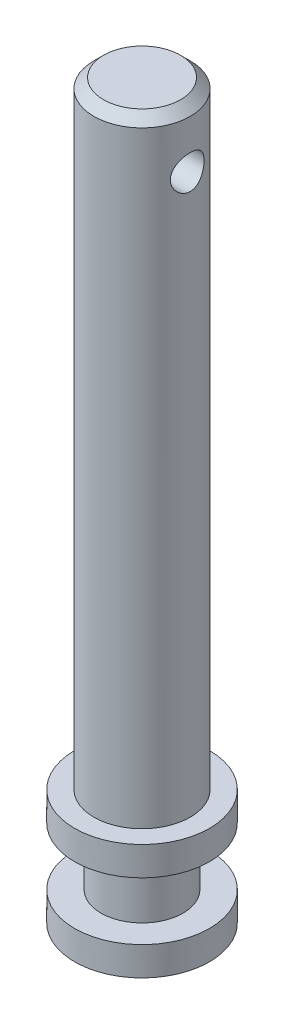
ISO-10303-21;
HEADER;
FILE_DESCRIPTION(('STEP AP214'),'2;1');
FILE_NAME('part.step','',(''),(''),'','','');
FILE_SCHEMA(('AUTOMOTIVE_DESIGN { 1 0 10303 214 1 1 1 1 }'));
ENDSEC;
DATA;
#1=APPLICATION_CONTEXT('core data for automotive mechanical design processes');
#2=APPLICATION_PROTOCOL_DEFINITION('international standard','automotive_design',2000,#1);
#3=PRODUCT_CONTEXT('',#1,'mechanical');
#4=PRODUCT('Part','Part','',(#3));
#5=PRODUCT_RELATED_PRODUCT_CATEGORY('part','',(#4));
#6=PRODUCT_DEFINITION_FORMATION('','',#4);
#7=PRODUCT_DEFINITION_CONTEXT('part definition',#1,'design');
#8=PRODUCT_DEFINITION('design','',#6,#7);
#9=PRODUCT_DEFINITION_SHAPE('','',#8);
#10=(LENGTH_UNIT() NAMED_UNIT(*) SI_UNIT(.MILLI.,.METRE.));
#11=(NAMED_UNIT(*) PLANE_ANGLE_UNIT() SI_UNIT($,.RADIAN.));
#12=(NAMED_UNIT(*) SI_UNIT($,.STERADIAN.) SOLID_ANGLE_UNIT());
#13=UNCERTAINTY_MEASURE_WITH_UNIT(LENGTH_MEASURE(1.E-05),#10,'distance_accuracy_value','');
#14=(GEOMETRIC_REPRESENTATION_CONTEXT(3) GLOBAL_UNCERTAINTY_ASSIGNED_CONTEXT((#13)) GLOBAL_UNIT_ASSIGNED_CONTEXT((#10,
#11,#12)) REPRESENTATION_CONTEXT('',''));
#15=CARTESIAN_POINT('',(0.,0.,0.));
#16=DIRECTION('',(0.,0.,1.));
#17=DIRECTION('',(1.,0.,0.));
#18=AXIS2_PLACEMENT_3D('',#15,#16,#17);
#19=CARTESIAN_POINT('',(-39.058136074314,-26.2499999999966,157.22281178723));
#20=DIRECTION('',(0.,1.,0.));
#21=DIRECTION('',(1.,0.,0.));
#22=AXIS2_PLACEMENT_3D('',#19,#20,#21);
#23=CYLINDRICAL_SURFACE('',#22,2.5);
#24=CARTESIAN_POINT('',(-39.058136074314,-41.4999999999966,157.22281178723));
#25=DIRECTION('',(0.,1.,0.));
#26=DIRECTION('',(0.,0.,1.));
#27=AXIS2_PLACEMENT_3D('',#24,#25,#26);
#28=CIRCLE('',#27,2.5);
#29=CARTESIAN_POINT('',(-39.058136074314,-41.4999999999966,159.72281178723));
#30=VERTEX_POINT('',#29);
#31=EDGE_CURVE('E11',#30,#30,#28,.T.);
#32=ORIENTED_EDGE('',*,*,#31,.T.);
#33=EDGE_LOOP('',(#32));
#34=FACE_BOUND('',#33,.T.);
#35=CARTESIAN_POINT('',(-41.4000103237135,-12.4999999999966,156.34781178723));
#36=CARTESIAN_POINT('',(-41.4000128155673,-12.4525643744031,156.347814581099));
#37=CARTESIAN_POINT('',(-41.4014699688432,-12.405080982804,156.351688048593));
#38=CARTESIAN_POINT('',(-41.4071189158149,-12.3114822821099,156.367041308693));
#39=CARTESIAN_POINT('',(-41.4113152416717,-12.2653693730179,156.378533707872));
#40=CARTESIAN_POINT('',(-41.4219066149587,-12.1759584925006,156.408661253374));
#41=CARTESIAN_POINT('',(-41.428295590332,-12.1326531358301,156.427276690216));
#42=CARTESIAN_POINT('',(-41.4425443595289,-12.049780368141,156.471063773624));
#43=CARTESIAN_POINT('',(-41.4504040694668,-12.0102127441288,156.496235046299));
#44=CARTESIAN_POINT('',(-41.4670917410137,-11.934206453069,156.553590361887));
#45=CARTESIAN_POINT('',(-41.4759456419171,-11.8979523340745,156.586011507403));
#46=CARTESIAN_POINT('',(-41.4934062894891,-11.8312670480141,156.656442660265));
#47=CARTESIAN_POINT('',(-41.502012979422,-11.8008372087035,156.694453938504));
#48=CARTESIAN_POINT('',(-41.5183112278842,-11.7458124363955,156.776349307166));
#49=CARTESIAN_POINT('',(-41.52596889802,-11.721412905451,156.820372030095));
#50=CARTESIAN_POINT('',(-41.5391994917302,-11.6804400413319,156.912211575258));
#51=CARTESIAN_POINT('',(-41.5447730450645,-11.6638643436229,156.960027246069));
#52=CARTESIAN_POINT('',(-41.5530241605874,-11.6396416058075,157.056164569138));
#53=CARTESIAN_POINT('',(-41.5558038508943,-11.6316788129222,157.10439773267));
#54=CARTESIAN_POINT('',(-41.5585181116683,-11.6239009561735,157.201590391781));
#55=CARTESIAN_POINT('',(-41.5584534893711,-11.6240835805844,157.250549677337));
#56=CARTESIAN_POINT('',(-41.5555539886184,-11.632397395959,157.345558837886));
#57=CARTESIAN_POINT('',(-41.5528388680633,-11.6401849763844,157.391643047599));
#58=CARTESIAN_POINT('',(-41.5450963861253,-11.6629157051348,157.481803741582));
#59=CARTESIAN_POINT('',(-41.5400688560821,-11.6778593754067,157.525880079146));
#60=CARTESIAN_POINT('',(-41.5281206014158,-11.7146627675042,157.611491546445));
#61=CARTESIAN_POINT('',(-41.5211747052606,-11.7366150956804,157.652983207425));
#62=CARTESIAN_POINT('',(-41.5061054879057,-11.7867332823933,157.731788911272));
#63=CARTESIAN_POINT('',(-41.4979818744656,-11.8149006840557,157.769101913155));
#64=CARTESIAN_POINT('',(-41.4809127973856,-11.8783476087382,157.840525823231));
#65=CARTESIAN_POINT('',(-41.4719465531903,-11.9139183665437,157.874373415935));
#66=CARTESIAN_POINT('',(-41.454544734501,-11.990313336596,157.935725090454));
#67=CARTESIAN_POINT('',(-41.4461094341923,-12.0311402305631,157.96322591396));
#68=CARTESIAN_POINT('',(-41.4306015494636,-12.1178142898754,158.011522368804));
#69=CARTESIAN_POINT('',(-41.4235559191753,-12.1637379343829,158.03218981816));
#70=CARTESIAN_POINT('',(-41.4119434232296,-12.2586762563588,158.065370398614));
#71=CARTESIAN_POINT('',(-41.4073712840484,-12.3076841070483,158.077900889367));
#72=CARTESIAN_POINT('',(-41.4029145791526,-12.3809683878494,158.090007114875));
#73=CARTESIAN_POINT('',(-41.4018294990079,-12.4046630677047,158.092929884686));
#74=CARTESIAN_POINT('',(-41.4003767424862,-12.4522344598068,158.096832928014));
#75=CARTESIAN_POINT('',(-41.400009068803,-12.4761111727367,158.097813194237));
#76=CARTESIAN_POINT('',(-41.4000128155672,-12.5474356255879,158.09780899336));
#77=CARTESIAN_POINT('',(-41.4014699688431,-12.594919017187,158.093935525867));
#78=CARTESIAN_POINT('',(-41.4071189158147,-12.6885177178811,158.078582265767));
#79=CARTESIAN_POINT('',(-41.4113152416715,-12.7346306269732,158.067089866588));
#80=CARTESIAN_POINT('',(-41.4219066149584,-12.8240415074904,158.036962321087));
#81=CARTESIAN_POINT('',(-41.4282955903317,-12.867346864161,158.018346884244));
#82=CARTESIAN_POINT('',(-41.4425443595285,-12.9502196318501,157.974559800836));
#83=CARTESIAN_POINT('',(-41.4504040694665,-12.9897872558624,157.949388528161));
#84=CARTESIAN_POINT('',(-41.4670917410133,-13.0657935469224,157.892033212574));
#85=CARTESIAN_POINT('',(-41.4759456419167,-13.102047665917,157.859612067058));
#86=CARTESIAN_POINT('',(-41.4934062894886,-13.1687329519775,157.789180914196));
#87=CARTESIAN_POINT('',(-41.5020129794216,-13.1991627912882,157.751169635957));
#88=CARTESIAN_POINT('',(-41.5183112278838,-13.2541875635965,157.669274267296));
#89=CARTESIAN_POINT('',(-41.5259688980197,-13.278587094541,157.625251544366));
#90=CARTESIAN_POINT('',(-41.5391994917299,-13.3195599586604,157.533411999204));
#91=CARTESIAN_POINT('',(-41.5447730450642,-13.3361356563696,157.485596328393));
#92=CARTESIAN_POINT('',(-41.5530241605873,-13.3603583941853,157.389459005324));
#93=CARTESIAN_POINT('',(-41.5558038508942,-13.3683211870707,157.341225841791));
#94=CARTESIAN_POINT('',(-41.5585181116683,-13.3760990438197,157.244033182681));
#95=CARTESIAN_POINT('',(-41.5584534893711,-13.3759164194089,157.195073897125));
#96=CARTESIAN_POINT('',(-41.5555539886185,-13.3676026040345,157.100064736575));
#97=CARTESIAN_POINT('',(-41.5528388680635,-13.3598150236093,157.053980526863));
#98=CARTESIAN_POINT('',(-41.5450963861255,-13.3370842948591,156.96381983288));
#99=CARTESIAN_POINT('',(-41.5400688560824,-13.3221406245873,156.919743495316));
#100=CARTESIAN_POINT('',(-41.5281206014161,-13.28533723249,156.834132028016));
#101=CARTESIAN_POINT('',(-41.521174705261,-13.2633849043139,156.792640367037));
#102=CARTESIAN_POINT('',(-41.5061054879062,-13.2132667176013,156.71383466319));
#103=CARTESIAN_POINT('',(-41.497981874466,-13.185099315939,156.676521661306));
#104=CARTESIAN_POINT('',(-41.480912797386,-13.1216523912567,156.60509775123));
#105=CARTESIAN_POINT('',(-41.4719465531908,-13.0860816334513,156.571250158527));
#106=CARTESIAN_POINT('',(-41.4545447345014,-13.0096866633992,156.509898484006));
#107=CARTESIAN_POINT('',(-41.4461094341927,-12.9688597694322,156.4823976605));
#108=CARTESIAN_POINT('',(-41.430601549464,-12.88218571012,156.434101205657));
#109=CARTESIAN_POINT('',(-41.4235559191757,-12.8362620656126,156.4134337563));
#110=CARTESIAN_POINT('',(-41.4119434232299,-12.7413237436368,156.380253175847));
#111=CARTESIAN_POINT('',(-41.4073712840486,-12.6923158929474,156.367722685093));
#112=CARTESIAN_POINT('',(-41.4029145791527,-12.6190316121455,156.355616459584));
#113=CARTESIAN_POINT('',(-41.4018294990079,-12.5953369322894,156.352693689773));
#114=CARTESIAN_POINT('',(-41.4003767424861,-12.5477655401858,156.348790646446));
#115=CARTESIAN_POINT('',(-41.4000090688029,-12.5238888272551,156.347810380223));
#116=CARTESIAN_POINT('',(-41.4000103237135,-12.4999999999966,156.34781178723));
#117=B_SPLINE_CURVE_WITH_KNOTS('',3,(#35,#36,#37,#38,#39,#40,#41,#42,#43,#44,#45,#46,#47,#48,
#49,#50,#51,#52,#53,#54,#55,#56,#57,#58,#59,#60,#61,#62,#63,#64,#65,#66,#67,#68,#69,#70,#71,#72,
#73,#74,#75,#76,#77,#78,#79,#80,#81,#82,#83,#84,#85,#86,#87,#88,#89,#90,#91,#92,#93,#94,#95,#96,
#97,#98,#99,#100,#101,#102,#103,#104,#105,#106,#107,#108,#109,#110,#111,#112,#113,#114,#115,
#116),.UNSPECIFIED.,.T.,.F.,(4,2,2,2,2,2,2,2,2,2,2,2,2,2,2,2,2,2,2,2,2,2,2,2,2,2,2,2,2,2,2,2,2,
2,2,2,2,2,2,2,4),(0.,0.142213785233003,0.284663472038125,0.426721817299711,0.568772062516017,
0.716415538396299,0.864092632428542,1.01606398397431,1.16798937698312,1.31413369781763,
1.46023654214992,1.60002973138888,1.73983311833968,1.88156602229608,2.02333415645526,
2.17239216200834,2.32152652172129,2.47331772809518,2.6247840248101,2.6964033562776,
2.7680229566641,2.91023674189706,3.05268642870212,3.19474477396364,3.33679501917988,
3.4844384950601,3.63211558909229,3.78408694063808,3.93601233364691,4.08215665448146,
4.22825949881383,4.36805268805281,4.50785607500365,4.64958897896,4.79135711311912,
4.94041511867215,5.08954947838504,5.24134068475893,5.3928069814739,5.46442631294372,
5.53604591333256),.UNSPECIFIED.);
#118=CARTESIAN_POINT('',(-41.4000103237135,-12.4999999999966,156.34781178723));
#119=VERTEX_POINT('',#118);
#120=EDGE_CURVE('E25',#119,#119,#117,.T.);
#121=ORIENTED_EDGE('',*,*,#120,.T.);
#122=EDGE_LOOP('',(#121));
#123=FACE_BOUND('',#122,.T.);
#124=CARTESIAN_POINT('',(-39.058136074314,-10.0000000000755,157.22281178723));
#125=DIRECTION('',(0.,-1.,0.));
#126=DIRECTION('',(0.,0.,-1.));
#127=AXIS2_PLACEMENT_3D('',#124,#125,#126);
#128=CIRCLE('',#127,2.5);
#129=CARTESIAN_POINT('',(-39.058136074314,-10.0000000000755,154.72281178723));
#130=VERTEX_POINT('',#129);
#131=EDGE_CURVE('E100',#130,#130,#128,.T.);
#132=ORIENTED_EDGE('',*,*,#131,.T.);
#133=EDGE_LOOP('',(#132));
#134=FACE_BOUND('',#133,.T.);
#135=CARTESIAN_POINT('',(-36.7162618249146,-12.4999999999966,156.34781178723));
#136=CARTESIAN_POINT('',(-36.7162593330608,-12.5474356255901,156.347814581099));
#137=CARTESIAN_POINT('',(-36.7148021797849,-12.5949190171892,156.351688048593));
#138=CARTESIAN_POINT('',(-36.7091532328132,-12.6885177178833,156.367041308693));
#139=CARTESIAN_POINT('',(-36.7049569069564,-12.7346306269753,156.378533707872));
#140=CARTESIAN_POINT('',(-36.6943655336694,-12.8240415074926,156.408661253374));
#141=CARTESIAN_POINT('',(-36.6879765582961,-12.8673468641631,156.427276690216));
#142=CARTESIAN_POINT('',(-36.6737277890992,-12.9502196318522,156.471063773624));
#143=CARTESIAN_POINT('',(-36.6658680791612,-12.9897872558644,156.496235046299));
#144=CARTESIAN_POINT('',(-36.6491804076144,-13.0657935469242,156.553590361887));
#145=CARTESIAN_POINT('',(-36.640326506711,-13.1020476659187,156.586011507403));
#146=CARTESIAN_POINT('',(-36.622865859139,-13.1687329519791,156.656442660265));
#147=CARTESIAN_POINT('',(-36.6142591692061,-13.1991627912897,156.694453938504));
#148=CARTESIAN_POINT('',(-36.5979609207439,-13.2541875635977,156.776349307166));
#149=CARTESIAN_POINT('',(-36.5903032506081,-13.2785870945422,156.820372030095));
#150=CARTESIAN_POINT('',(-36.5770726568979,-13.3195599586613,156.912211575258));
#151=CARTESIAN_POINT('',(-36.5714991035636,-13.3361356563703,156.960027246069));
#152=CARTESIAN_POINT('',(-36.5632479880407,-13.3603583941857,157.056164569138));
#153=CARTESIAN_POINT('',(-36.5604682977338,-13.368321187071,157.10439773267));
#154=CARTESIAN_POINT('',(-36.5577540369598,-13.3760990438198,157.201590391781));
#155=CARTESIAN_POINT('',(-36.557818659257,-13.3759164194088,157.250549677337));
#156=CARTESIAN_POINT('',(-36.5607181600097,-13.3676026040342,157.345558837886));
#157=CARTESIAN_POINT('',(-36.5634332805648,-13.3598150236088,157.391643047599));
#158=CARTESIAN_POINT('',(-36.5711757625028,-13.3370842948584,157.481803741582));
#159=CARTESIAN_POINT('',(-36.576203292546,-13.3221406245865,157.525880079146));
#160=CARTESIAN_POINT('',(-36.5881515472123,-13.285337232489,157.611491546445));
#161=CARTESIAN_POINT('',(-36.5950974433675,-13.2633849043128,157.652983207425));
#162=CARTESIAN_POINT('',(-36.6101666607223,-13.2132667175999,157.731788911272));
#163=CARTESIAN_POINT('',(-36.6182902741625,-13.1850993159375,157.769101913155));
#164=CARTESIAN_POINT('',(-36.6353593512425,-13.121652391255,157.840525823231));
#165=CARTESIAN_POINT('',(-36.6443255954378,-13.0860816334495,157.874373415935));
#166=CARTESIAN_POINT('',(-36.6617274141271,-13.0096866633972,157.935725090454));
#167=CARTESIAN_POINT('',(-36.6701627144358,-12.9688597694301,157.96322591396));
#168=CARTESIAN_POINT('',(-36.6856705991645,-12.8821857101178,158.011522368804));
#169=CARTESIAN_POINT('',(-36.6927162294528,-12.8362620656103,158.03218981816));
#170=CARTESIAN_POINT('',(-36.7043287253985,-12.7413237436344,158.065370398614));
#171=CARTESIAN_POINT('',(-36.7089008645797,-12.6923158929449,158.077900889367));
#172=CARTESIAN_POINT('',(-36.7133575694755,-12.6190316121438,158.090007114875));
#173=CARTESIAN_POINT('',(-36.7144426496202,-12.5953369322885,158.092929884686));
#174=CARTESIAN_POINT('',(-36.7158954061419,-12.5477655401864,158.096832928014));
#175=CARTESIAN_POINT('',(-36.7162630798251,-12.5238888272565,158.097813194237));
#176=CARTESIAN_POINT('',(-36.7162593330609,-12.4525643744053,158.09780899336));
#177=CARTESIAN_POINT('',(-36.714802179785,-12.4050809828062,158.093935525867));
#178=CARTESIAN_POINT('',(-36.7091532328134,-12.3114822821121,158.078582265767));
#179=CARTESIAN_POINT('',(-36.7049569069566,-12.26536937302,158.067089866588));
#180=CARTESIAN_POINT('',(-36.6943655336697,-12.1759584925028,158.036962321087));
#181=CARTESIAN_POINT('',(-36.6879765582964,-12.1326531358322,158.018346884244));
#182=CARTESIAN_POINT('',(-36.6737277890996,-12.049780368143,157.974559800836));
#183=CARTESIAN_POINT('',(-36.6658680791616,-12.0102127441307,157.949388528161));
#184=CARTESIAN_POINT('',(-36.6491804076148,-11.9342064530708,157.892033212574));
#185=CARTESIAN_POINT('',(-36.6403265067114,-11.8979523340762,157.859612067058));
#186=CARTESIAN_POINT('',(-36.6228658591395,-11.8312670480157,157.789180914196));
#187=CARTESIAN_POINT('',(-36.6142591692065,-11.800837208705,157.751169635957));
#188=CARTESIAN_POINT('',(-36.5979609207443,-11.7458124363967,157.669274267296));
#189=CARTESIAN_POINT('',(-36.5903032506084,-11.7214129054522,157.625251544366));
#190=CARTESIAN_POINT('',(-36.5770726568982,-11.6804400413328,157.533411999204));
#191=CARTESIAN_POINT('',(-36.5714991035639,-11.6638643436236,157.485596328393));
#192=CARTESIAN_POINT('',(-36.5632479880408,-11.6396416058079,157.389459005324));
#193=CARTESIAN_POINT('',(-36.5604682977339,-11.6316788129225,157.341225841791));
#194=CARTESIAN_POINT('',(-36.5577540369598,-11.6239009561735,157.244033182681));
#195=CARTESIAN_POINT('',(-36.557818659257,-11.6240835805843,157.195073897125));
#196=CARTESIAN_POINT('',(-36.5607181600096,-11.6323973959587,157.100064736575));
#197=CARTESIAN_POINT('',(-36.5634332805646,-11.6401849763839,157.053980526863));
#198=CARTESIAN_POINT('',(-36.5711757625026,-11.6629157051341,156.96381983288));
#199=CARTESIAN_POINT('',(-36.5762032925457,-11.6778593754059,156.919743495316));
#200=CARTESIAN_POINT('',(-36.588151547212,-11.7146627675032,156.834132028016));
#201=CARTESIAN_POINT('',(-36.5950974433671,-11.7366150956793,156.792640367037));
#202=CARTESIAN_POINT('',(-36.610166660722,-11.7867332823919,156.71383466319));
#203=CARTESIAN_POINT('',(-36.6182902741621,-11.8149006840542,156.676521661306));
#204=CARTESIAN_POINT('',(-36.6353593512421,-11.8783476087365,156.60509775123));
#205=CARTESIAN_POINT('',(-36.6443255954373,-11.9139183665419,156.571250158527));
#206=CARTESIAN_POINT('',(-36.6617274141267,-11.9903133365941,156.509898484006));
#207=CARTESIAN_POINT('',(-36.6701627144354,-12.031140230561,156.4823976605));
#208=CARTESIAN_POINT('',(-36.6856705991641,-12.1178142898732,156.434101205657));
#209=CARTESIAN_POINT('',(-36.6927162294524,-12.1637379343806,156.4134337563));
#210=CARTESIAN_POINT('',(-36.7043287253982,-12.2586762563564,156.380253175847));
#211=CARTESIAN_POINT('',(-36.7089008645795,-12.3076841070458,156.367722685093));
#212=CARTESIAN_POINT('',(-36.7133575694754,-12.3809683878477,156.355616459584));
#213=CARTESIAN_POINT('',(-36.7144426496202,-12.4046630677038,156.352693689773));
#214=CARTESIAN_POINT('',(-36.715895406142,-12.4522344598074,156.348790646446));
#215=CARTESIAN_POINT('',(-36.7162630798252,-12.4761111727381,156.347810380223));
#216=CARTESIAN_POINT('',(-36.7162618249146,-12.4999999999966,156.34781178723));
#217=B_SPLINE_CURVE_WITH_KNOTS('',3,(#135,#136,#137,#138,#139,#140,#141,#142,#143,#144,#145,
#146,#147,#148,#149,#150,#151,#152,#153,#154,#155,#156,#157,#158,#159,#160,#161,#162,#163,#164,
#165,#166,#167,#168,#169,#170,#171,#172,#173,#174,#175,#176,#177,#178,#179,#180,#181,#182,#183,
#184,#185,#186,#187,#188,#189,#190,#191,#192,#193,#194,#195,#196,#197,#198,#199,#200,#201,#202,
#203,#204,#205,#206,#207,#208,#209,#210,#211,#212,#213,#214,#215,#216),.UNSPECIFIED.,.T.,.F.,(4,
2,2,2,2,2,2,2,2,2,2,2,2,2,2,2,2,2,2,2,2,2,2,2,2,2,2,2,2,2,2,2,2,2,2,2,2,2,2,2,4),(0.,
0.142213785233007,0.284663472038125,0.426721817299711,0.568772062516018,0.716415538396299,
0.864092632428543,1.01606398397431,1.16798937698312,1.31413369781763,1.46023654214992,
1.60002973138888,1.73983311833968,1.88156602229611,2.02333415645529,2.17239216200834,
2.3215265217213,2.47331772809518,2.62478402481011,2.6964033562776,2.7680229566641,
2.91023674189706,3.05268642870213,3.19474477396368,3.33679501917991,3.48443849506013,
3.63211558909229,3.78408694063808,3.93601233364691,4.08215665448146,4.22825949881383,
4.36805268805281,4.50785607500368,4.64958897896003,4.79135711311916,4.94041511867216,
5.08954947838504,5.24134068475894,5.39280698147391,5.46442631294372,5.53604591333256),.UNSPECIFIED.);
#218=CARTESIAN_POINT('',(-36.7162618249146,-12.4999999999966,156.34781178723));
#219=VERTEX_POINT('',#218);
#220=EDGE_CURVE('E94',#219,#219,#217,.T.);
#221=ORIENTED_EDGE('',*,*,#220,.T.);
#222=EDGE_LOOP('',(#221));
#223=FACE_BOUND('',#222,.T.);
#224=ADVANCED_FACE('F16',(#34,#123,#134,#223),#23,.T.);
#225=CARTESIAN_POINT('',(-34.058136074314,-12.4999999999966,157.22281178723));
#226=DIRECTION('',(1.,0.,0.));
#227=DIRECTION('',(0.,1.,0.));
#228=AXIS2_PLACEMENT_3D('',#225,#226,#227);
#229=CYLINDRICAL_SURFACE('',#228,0.874999999999987);
#230=ORIENTED_EDGE('',*,*,#120,.F.);
#231=EDGE_LOOP('',(#230));
#232=FACE_BOUND('',#231,.T.);
#233=ORIENTED_EDGE('',*,*,#220,.F.);
#234=EDGE_LOOP('',(#233));
#235=FACE_BOUND('',#234,.T.);
#236=ADVANCED_FACE('F18',(#232,#235),#229,.F.);
#237=CARTESIAN_POINT('',(-39.058136074314,-9.99999999999091,157.22281178723));
#238=DIRECTION('',(0.,-1.,0.));
#239=DIRECTION('',(0.,0.,-1.));
#240=AXIS2_PLACEMENT_3D('',#237,#238,#239);
#241=CONICAL_SURFACE('',#240,2.49999999991538,0.785398163397448);
#242=CARTESIAN_POINT('',(-39.058136074314,-9.4999999999966,157.22281178723));
#243=DIRECTION('',(0.,1.,0.));
#244=DIRECTION('',(0.,0.,1.));
#245=AXIS2_PLACEMENT_3D('',#242,#243,#244);
#246=CIRCLE('',#245,1.99999999992107);
#247=CARTESIAN_POINT('',(-39.058136074314,-9.4999999999966,159.222811787151));
#248=VERTEX_POINT('',#247);
#249=EDGE_CURVE('E101',#248,#248,#246,.F.);
#250=ORIENTED_EDGE('',*,*,#249,.T.);
#251=EDGE_LOOP('',(#250));
#252=FACE_BOUND('',#251,.T.);
#253=ORIENTED_EDGE('',*,*,#131,.F.);
#254=EDGE_LOOP('',(#253));
#255=FACE_BOUND('',#254,.T.);
#256=ADVANCED_FACE('F64',(#252,#255),#241,.T.);
#257=CARTESIAN_POINT('',(-39.058136074314,-42.2499999999966,157.22281178723));
#258=DIRECTION('',(0.,1.,0.));
#259=DIRECTION('',(1.,0.,0.));
#260=AXIS2_PLACEMENT_3D('',#257,#258,#259);
#261=CYLINDRICAL_SURFACE('',#260,3.5);
#262=CARTESIAN_POINT('',(-39.058136074314,-42.9999999999966,157.22281178723));
#263=DIRECTION('',(0.,-1.,0.));
#264=DIRECTION('',(0.,0.,-1.));
#265=AXIS2_PLACEMENT_3D('',#262,#263,#264);
#266=CIRCLE('',#265,3.5);
#267=CARTESIAN_POINT('',(-39.058136074314,-42.9999999999966,153.72281178723));
#268=VERTEX_POINT('',#267);
#269=EDGE_CURVE('E104',#268,#268,#266,.F.);
#270=ORIENTED_EDGE('',*,*,#269,.T.);
#271=EDGE_LOOP('',(#270));
#272=FACE_BOUND('',#271,.T.);
#273=CARTESIAN_POINT('',(-39.058136074314,-41.4999999999966,157.22281178723));
#274=DIRECTION('',(0.,1.,0.));
#275=DIRECTION('',(0.,0.,1.));
#276=AXIS2_PLACEMENT_3D('',#273,#274,#275);
#277=CIRCLE('',#276,3.5);
#278=CARTESIAN_POINT('',(-39.058136074314,-41.4999999999966,160.72281178723));
#279=VERTEX_POINT('',#278);
#280=EDGE_CURVE('E21',#279,#279,#277,.T.);
#281=ORIENTED_EDGE('',*,*,#280,.F.);
#282=EDGE_LOOP('',(#281));
#283=FACE_BOUND('',#282,.T.);
#284=ADVANCED_FACE('F61',(#272,#283),#261,.T.);
#285=CARTESIAN_POINT('',(-39.058136074314,-44.4999999999966,157.22281178723));
#286=DIRECTION('',(0.,1.,0.));
#287=DIRECTION('',(1.,0.,0.));
#288=AXIS2_PLACEMENT_3D('',#285,#286,#287);
#289=CYLINDRICAL_SURFACE('',#288,2.12499999999999);
#290=CARTESIAN_POINT('',(-39.058136074314,-45.9999999999966,157.22281178723));
#291=DIRECTION('',(0.,1.,0.));
#292=DIRECTION('',(0.,0.,1.));
#293=AXIS2_PLACEMENT_3D('',#290,#291,#292);
#294=CIRCLE('',#293,2.12499999999999);
#295=CARTESIAN_POINT('',(-39.058136074314,-45.9999999999966,159.34781178723));
#296=VERTEX_POINT('',#295);
#297=EDGE_CURVE('E43',#296,#296,#294,.T.);
#298=ORIENTED_EDGE('',*,*,#297,.T.);
#299=EDGE_LOOP('',(#298));
#300=FACE_BOUND('',#299,.T.);
#301=CARTESIAN_POINT('',(-39.058136074314,-42.9999999999966,157.22281178723));
#302=DIRECTION('',(0.,-1.,0.));
#303=DIRECTION('',(0.,0.,-1.));
#304=AXIS2_PLACEMENT_3D('',#301,#302,#303);
#305=CIRCLE('',#304,2.12499999999999);
#306=CARTESIAN_POINT('',(-39.058136074314,-42.9999999999966,155.09781178723));
#307=VERTEX_POINT('',#306);
#308=EDGE_CURVE('E51',#307,#307,#305,.F.);
#309=ORIENTED_EDGE('',*,*,#308,.F.);
#310=EDGE_LOOP('',(#309));
#311=FACE_BOUND('',#310,.T.);
#312=ADVANCED_FACE('F63',(#300,#311),#289,.T.);
#313=CARTESIAN_POINT('',(-39.058136074314,-46.7499999999966,157.22281178723));
#314=DIRECTION('',(0.,1.,0.));
#315=DIRECTION('',(1.,0.,0.));
#316=AXIS2_PLACEMENT_3D('',#313,#314,#315);
#317=CYLINDRICAL_SURFACE('',#316,3.5);
#318=CARTESIAN_POINT('',(-39.058136074314,-47.4999999999966,157.22281178723));
#319=DIRECTION('',(0.,-1.,0.));
#320=DIRECTION('',(0.,0.,-1.));
#321=AXIS2_PLACEMENT_3D('',#318,#319,#320);
#322=CIRCLE('',#321,3.5);
#323=CARTESIAN_POINT('',(-39.058136074314,-47.4999999999966,153.72281178723));
#324=VERTEX_POINT('',#323);
#325=EDGE_CURVE('E39',#324,#324,#322,.F.);
#326=ORIENTED_EDGE('',*,*,#325,.T.);
#327=EDGE_LOOP('',(#326));
#328=FACE_BOUND('',#327,.T.);
#329=CARTESIAN_POINT('',(-39.058136074314,-45.9999999999966,157.22281178723));
#330=DIRECTION('',(0.,1.,0.));
#331=DIRECTION('',(0.,0.,1.));
#332=AXIS2_PLACEMENT_3D('',#329,#330,#331);
#333=CIRCLE('',#332,3.5);
#334=CARTESIAN_POINT('',(-39.058136074314,-45.9999999999966,160.72281178723));
#335=VERTEX_POINT('',#334);
#336=EDGE_CURVE('E46',#335,#335,#333,.T.);
#337=ORIENTED_EDGE('',*,*,#336,.F.);
#338=EDGE_LOOP('',(#337));
#339=FACE_BOUND('',#338,.T.);
#340=ADVANCED_FACE('F72',(#328,#339),#317,.T.);
#341=CARTESIAN_POINT('',(-39.058136074314,-47.4999999999966,157.22281178723));
#342=DIRECTION('',(0.,1.,0.));
#343=DIRECTION('',(1.,0.,0.));
#344=AXIS2_PLACEMENT_3D('',#341,#342,#343);
#345=CYLINDRICAL_SURFACE('',#344,2.75);
#346=CARTESIAN_POINT('',(-39.058136074314,-47.4999999999966,157.22281178723));
#347=DIRECTION('',(0.,-1.,0.));
#348=DIRECTION('',(0.,0.,-1.));
#349=AXIS2_PLACEMENT_3D('',#346,#347,#348);
#350=CIRCLE('',#349,2.75);
#351=CARTESIAN_POINT('',(-39.058136074314,-47.4999999999966,154.47281178723));
#352=VERTEX_POINT('',#351);
#353=EDGE_CURVE('E40',#352,#352,#350,.F.);
#354=ORIENTED_EDGE('',*,*,#353,.F.);
#355=EDGE_LOOP('',(#354));
#356=FACE_BOUND('',#355,.T.);
#357=CARTESIAN_POINT('',(-39.0581360742317,-47.2499999999627,157.22281178723));
#358=DIRECTION('',(0.,-1.,0.));
#359=DIRECTION('',(0.,0.,-1.));
#360=AXIS2_PLACEMENT_3D('',#357,#358,#359);
#361=CIRCLE('',#360,2.75);
#362=CARTESIAN_POINT('',(-39.0581360742317,-47.2499999999627,154.47281178723));
#363=VERTEX_POINT('',#362);
#364=EDGE_CURVE('E37',#363,#363,#361,.F.);
#365=ORIENTED_EDGE('',*,*,#364,.T.);
#366=EDGE_LOOP('',(#365));
#367=FACE_BOUND('',#366,.T.);
#368=ADVANCED_FACE('F33',(#356,#367),#345,.F.);
#369=CARTESIAN_POINT('',(-39.0581360742317,-1046.51313972079,157.22281178723));
#370=DIRECTION('',(0.,-1.,0.));
#371=DIRECTION('',(0.,0.,-1.));
#372=AXIS2_PLACEMENT_3D('',#369,#370,#371);
#373=CONICAL_SURFACE('',#372,3732.05080761796,1.30899693899904);
#374=CARTESIAN_POINT('',(-39.0581360742317,-46.513139720787,157.22281178723));
#375=VERTEX_POINT('',#374);
#376=VERTEX_LOOP('',#375);
#377=FACE_BOUND('',#376,.T.);
#378=ORIENTED_EDGE('',*,*,#364,.F.);
#379=EDGE_LOOP('',(#378));
#380=FACE_BOUND('',#379,.T.);
#381=ADVANCED_FACE('F29',(#377,#380),#373,.F.);
#382=CARTESIAN_POINT('',(-42.183136074314,-47.4999999999966,157.22281178723));
#383=DIRECTION('',(0.,-1.,0.));
#384=DIRECTION('',(0.,0.,-1.));
#385=AXIS2_PLACEMENT_3D('',#382,#383,#384);
#386=PLANE('',#385);
#387=ORIENTED_EDGE('',*,*,#325,.F.);
#388=EDGE_LOOP('',(#387));
#389=FACE_BOUND('',#388,.T.);
#390=ORIENTED_EDGE('',*,*,#353,.T.);
#391=EDGE_LOOP('',(#390));
#392=FACE_BOUND('',#391,.T.);
#393=ADVANCED_FACE('F32',(#389,#392),#386,.T.);
#394=CARTESIAN_POINT('',(-41.870636074314,-45.9999999999966,157.22281178723));
#395=DIRECTION('',(0.,1.,0.));
#396=DIRECTION('',(0.,0.,1.));
#397=AXIS2_PLACEMENT_3D('',#394,#395,#396);
#398=PLANE('',#397);
#399=ORIENTED_EDGE('',*,*,#336,.T.);
#400=EDGE_LOOP('',(#399));
#401=FACE_BOUND('',#400,.T.);
#402=ORIENTED_EDGE('',*,*,#297,.F.);
#403=EDGE_LOOP('',(#402));
#404=FACE_BOUND('',#403,.T.);
#405=ADVANCED_FACE('F109',(#401,#404),#398,.T.);
#406=CARTESIAN_POINT('',(-41.870636074314,-42.9999999999966,157.22281178723));
#407=DIRECTION('',(0.,-1.,0.));
#408=DIRECTION('',(0.,0.,-1.));
#409=AXIS2_PLACEMENT_3D('',#406,#407,#408);
#410=PLANE('',#409);
#411=ORIENTED_EDGE('',*,*,#269,.F.);
#412=EDGE_LOOP('',(#411));
#413=FACE_BOUND('',#412,.T.);
#414=ORIENTED_EDGE('',*,*,#308,.T.);
#415=EDGE_LOOP('',(#414));
#416=FACE_BOUND('',#415,.T.);
#417=ADVANCED_FACE('F111',(#413,#416),#410,.T.);
#418=CARTESIAN_POINT('',(-40.0581360743141,-9.4999999999966,157.22281178723));
#419=DIRECTION('',(0.,1.,0.));
#420=DIRECTION('',(0.,0.,1.));
#421=AXIS2_PLACEMENT_3D('',#418,#419,#420);
#422=PLANE('',#421);
#423=ORIENTED_EDGE('',*,*,#249,.F.);
#424=EDGE_LOOP('',(#423));
#425=FACE_BOUND('',#424,.T.);
#426=ADVANCED_FACE('F118',(#425),#422,.T.);
#427=CARTESIAN_POINT('',(-42.058136074314,-41.4999999999966,157.22281178723));
#428=DIRECTION('',(0.,1.,0.));
#429=DIRECTION('',(0.,0.,1.));
#430=AXIS2_PLACEMENT_3D('',#427,#428,#429);
#431=PLANE('',#430);
#432=ORIENTED_EDGE('',*,*,#280,.T.);
#433=EDGE_LOOP('',(#432));
#434=FACE_BOUND('',#433,.T.);
#435=ORIENTED_EDGE('',*,*,#31,.F.);
#436=EDGE_LOOP('',(#435));
#437=FACE_BOUND('',#436,.T.);
#438=ADVANCED_FACE('F58',(#434,#437),#431,.T.);
#439=CLOSED_SHELL('',(#224,#236,#256,#284,#312,#340,#368,#381,#393,#405,#417,#426,#438));
#440=MANIFOLD_SOLID_BREP('B1',#439);
#441=ADVANCED_BREP_SHAPE_REPRESENTATION('',(#18,#440),#14);
#442=SHAPE_DEFINITION_REPRESENTATION(#9,#441);
ENDSEC;
END-ISO-10303-21;
